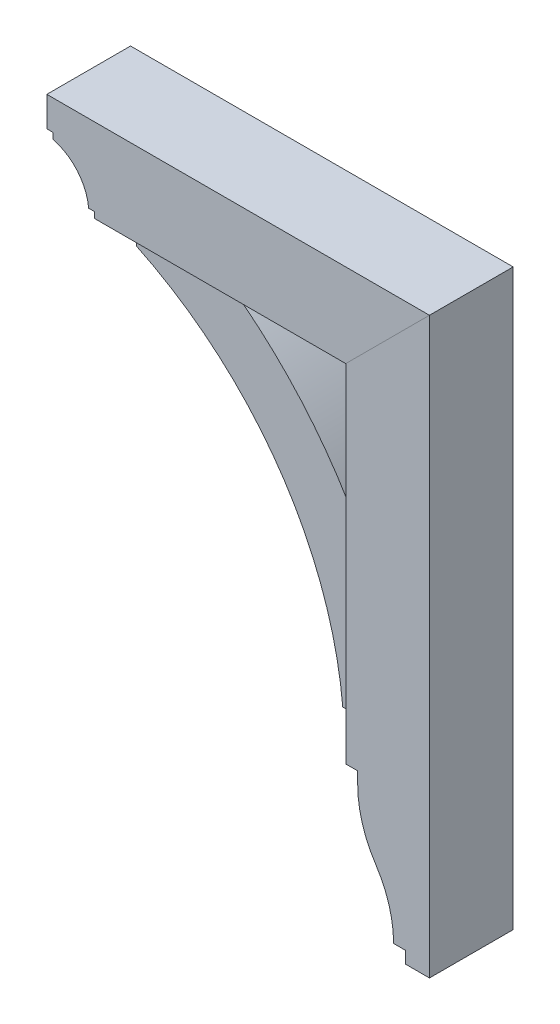
ISO-10303-21;
HEADER;
FILE_DESCRIPTION(('STEP AP214'),'2;1');
FILE_NAME('part.step','',(''),(''),'','','');
FILE_SCHEMA(('AUTOMOTIVE_DESIGN { 1 0 10303 214 1 1 1 1 }'));
ENDSEC;
DATA;
#1=APPLICATION_CONTEXT('core data for automotive mechanical design processes');
#2=APPLICATION_PROTOCOL_DEFINITION('international standard','automotive_design',2000,#1);
#3=PRODUCT_CONTEXT('',#1,'mechanical');
#4=PRODUCT('Part','Part','',(#3));
#5=PRODUCT_RELATED_PRODUCT_CATEGORY('part','',(#4));
#6=PRODUCT_DEFINITION_FORMATION('','',#4);
#7=PRODUCT_DEFINITION_CONTEXT('part definition',#1,'design');
#8=PRODUCT_DEFINITION('design','',#6,#7);
#9=PRODUCT_DEFINITION_SHAPE('','',#8);
#10=(LENGTH_UNIT() NAMED_UNIT(*) SI_UNIT(.MILLI.,.METRE.));
#11=(NAMED_UNIT(*) PLANE_ANGLE_UNIT() SI_UNIT($,.RADIAN.));
#12=(NAMED_UNIT(*) SI_UNIT($,.STERADIAN.) SOLID_ANGLE_UNIT());
#13=UNCERTAINTY_MEASURE_WITH_UNIT(LENGTH_MEASURE(1.E-05),#10,'distance_accuracy_value','');
#14=(GEOMETRIC_REPRESENTATION_CONTEXT(3) GLOBAL_UNCERTAINTY_ASSIGNED_CONTEXT((#13)) GLOBAL_UNIT_ASSIGNED_CONTEXT((#10,
#11,#12)) REPRESENTATION_CONTEXT('',''));
#15=CARTESIAN_POINT('',(0.,0.,0.));
#16=DIRECTION('',(0.,0.,1.));
#17=DIRECTION('',(1.,0.,0.));
#18=AXIS2_PLACEMENT_3D('',#15,#16,#17);
#19=CARTESIAN_POINT('',(246.881223015558,-2.15821431605898E-12,44.45));
#20=DIRECTION('',(1.,0.,0.));
#21=DIRECTION('',(0.,1.,0.));
#22=AXIS2_PLACEMENT_3D('',#19,#20,#21);
#23=PLANE('',#22);
#24=DIRECTION('',(0.,-1.,0.));
#25=VECTOR('',#24,1.);
#26=CARTESIAN_POINT('',(246.881223015558,-2.15821431605898E-12,-44.45));
#27=LINE('',#26,#25);
#28=CARTESIAN_POINT('',(246.881223015556,-183.515,-44.45));
#29=VERTEX_POINT('',#28);
#30=CARTESIAN_POINT('',(246.881223015556,-196.215,-44.45));
#31=VERTEX_POINT('',#30);
#32=EDGE_CURVE('E171',#29,#31,#27,.T.);
#33=ORIENTED_EDGE('',*,*,#32,.T.);
#34=DIRECTION('',(0.,0.,-1.));
#35=VECTOR('',#34,1.);
#36=CARTESIAN_POINT('',(246.881223015556,-196.215,44.45));
#37=LINE('',#36,#35);
#38=CARTESIAN_POINT('',(246.881223015556,-196.215,44.45));
#39=VERTEX_POINT('',#38);
#40=EDGE_CURVE('E12',#39,#31,#37,.T.);
#41=ORIENTED_EDGE('',*,*,#40,.F.);
#42=DIRECTION('',(0.,-1.,0.));
#43=VECTOR('',#42,1.);
#44=CARTESIAN_POINT('',(246.881223015558,-2.15821431605898E-12,44.45));
#45=LINE('',#44,#43);
#46=CARTESIAN_POINT('',(246.881223015556,-183.515,44.45));
#47=VERTEX_POINT('',#46);
#48=EDGE_CURVE('E202',#47,#39,#45,.T.);
#49=ORIENTED_EDGE('',*,*,#48,.F.);
#50=DIRECTION('',(0.,0.,-1.));
#51=VECTOR('',#50,1.);
#52=CARTESIAN_POINT('',(246.881223015556,-183.515,44.45));
#53=LINE('',#52,#51);
#54=EDGE_CURVE('E167',#47,#29,#53,.T.);
#55=ORIENTED_EDGE('',*,*,#54,.T.);
#56=EDGE_LOOP('',(#33,#41,#49,#55));
#57=FACE_BOUND('',#56,.T.);
#58=ADVANCED_FACE('F55',(#57),#23,.F.);
#59=CARTESIAN_POINT('',(362.768723015556,-196.215,44.45));
#60=DIRECTION('',(0.,0.,-1.));
#61=DIRECTION('',(-1.,0.,0.));
#62=AXIS2_PLACEMENT_3D('',#59,#60,#61);
#63=CYLINDRICAL_SURFACE('',#62,115.8875);
#64=CARTESIAN_POINT('',(362.768723015556,-196.215,-44.45));
#65=DIRECTION('',(0.,0.,1.));
#66=DIRECTION('',(1.,0.,0.));
#67=AXIS2_PLACEMENT_3D('',#64,#65,#66);
#68=CIRCLE('',#67,115.8875);
#69=CARTESIAN_POINT('',(266.018608336656,-260.006284403668,-44.45));
#70=VERTEX_POINT('',#69);
#71=EDGE_CURVE('E174',#31,#70,#68,.T.);
#72=ORIENTED_EDGE('',*,*,#71,.T.);
#73=DIRECTION('',(0.,0.,-1.));
#74=VECTOR('',#73,1.);
#75=CARTESIAN_POINT('',(266.018608336656,-260.006284403668,44.45));
#76=LINE('',#75,#74);
#77=CARTESIAN_POINT('',(266.018608336656,-260.006284403668,44.45));
#78=VERTEX_POINT('',#77);
#79=EDGE_CURVE('E64',#78,#70,#76,.T.);
#80=ORIENTED_EDGE('',*,*,#79,.F.);
#81=CARTESIAN_POINT('',(362.768723015556,-196.215,44.45));
#82=DIRECTION('',(0.,0.,1.));
#83=DIRECTION('',(1.,0.,0.));
#84=AXIS2_PLACEMENT_3D('',#81,#82,#83);
#85=CIRCLE('',#84,115.8875);
#86=EDGE_CURVE('E121',#39,#78,#85,.T.);
#87=ORIENTED_EDGE('',*,*,#86,.F.);
#88=ORIENTED_EDGE('',*,*,#40,.T.);
#89=EDGE_LOOP('',(#72,#80,#87,#88));
#90=FACE_BOUND('',#89,.T.);
#91=ADVANCED_FACE('F228',(#90),#63,.T.);
#92=CARTESIAN_POINT('',(170.152056348884,-323.215,44.45));
#93=DIRECTION('',(0.,0.,-1.));
#94=DIRECTION('',(-1.,0.,0.));
#95=AXIS2_PLACEMENT_3D('',#92,#93,#94);
#96=CYLINDRICAL_SURFACE('',#95,114.829166666671);
#97=CARTESIAN_POINT('',(170.152056348884,-323.215,-44.45));
#98=DIRECTION('',(0.,0.,1.));
#99=DIRECTION('',(1.,0.,0.));
#100=AXIS2_PLACEMENT_3D('',#97,#98,#99);
#101=CIRCLE('',#100,114.829166666671);
#102=CARTESIAN_POINT('',(284.981223015555,-323.215,-44.45));
#103=VERTEX_POINT('',#102);
#104=EDGE_CURVE('E178',#103,#70,#101,.T.);
#105=ORIENTED_EDGE('',*,*,#104,.F.);
#106=DIRECTION('',(0.,0.,-1.));
#107=VECTOR('',#106,1.);
#108=CARTESIAN_POINT('',(284.981223015555,-323.215,44.45));
#109=LINE('',#108,#107);
#110=CARTESIAN_POINT('',(284.981223015555,-323.215,44.45));
#111=VERTEX_POINT('',#110);
#112=EDGE_CURVE('E218',#111,#103,#109,.T.);
#113=ORIENTED_EDGE('',*,*,#112,.F.);
#114=CARTESIAN_POINT('',(170.152056348884,-323.215,44.45));
#115=DIRECTION('',(0.,0.,1.));
#116=DIRECTION('',(1.,0.,0.));
#117=AXIS2_PLACEMENT_3D('',#114,#115,#116);
#118=CIRCLE('',#117,114.829166666671);
#119=EDGE_CURVE('E227',#111,#78,#118,.T.);
#120=ORIENTED_EDGE('',*,*,#119,.T.);
#121=ORIENTED_EDGE('',*,*,#79,.T.);
#122=EDGE_LOOP('',(#105,#113,#120,#121));
#123=FACE_BOUND('',#122,.T.);
#124=ADVANCED_FACE('F225',(#123),#96,.F.);
#125=CARTESIAN_POINT('',(0.,-323.215,44.45));
#126=DIRECTION('',(0.,-1.,0.));
#127=DIRECTION('',(0.,0.,-1.));
#128=AXIS2_PLACEMENT_3D('',#125,#126,#127);
#129=PLANE('',#128);
#130=DIRECTION('',(-1.,0.,0.));
#131=VECTOR('',#130,1.);
#132=CARTESIAN_POINT('',(0.,-323.215,-44.45));
#133=LINE('',#132,#131);
#134=CARTESIAN_POINT('',(297.681223015555,-323.215,-44.45));
#135=VERTEX_POINT('',#134);
#136=EDGE_CURVE('E182',#135,#103,#133,.T.);
#137=ORIENTED_EDGE('',*,*,#136,.F.);
#138=DIRECTION('',(0.,0.,-1.));
#139=VECTOR('',#138,1.);
#140=CARTESIAN_POINT('',(297.681223015555,-323.215,44.45));
#141=LINE('',#140,#139);
#142=CARTESIAN_POINT('',(297.681223015555,-323.215,44.45));
#143=VERTEX_POINT('',#142);
#144=EDGE_CURVE('E215',#143,#135,#141,.T.);
#145=ORIENTED_EDGE('',*,*,#144,.F.);
#146=DIRECTION('',(-1.,0.,0.));
#147=VECTOR('',#146,1.);
#148=CARTESIAN_POINT('',(0.,-323.215,44.45));
#149=LINE('',#148,#147);
#150=EDGE_CURVE('E239',#143,#111,#149,.T.);
#151=ORIENTED_EDGE('',*,*,#150,.T.);
#152=ORIENTED_EDGE('',*,*,#112,.T.);
#153=EDGE_LOOP('',(#137,#145,#151,#152));
#154=FACE_BOUND('',#153,.T.);
#155=ADVANCED_FACE('F236',(#154),#129,.T.);
#156=CARTESIAN_POINT('',(297.681223015555,0.,44.45));
#157=DIRECTION('',(-1.,0.,0.));
#158=DIRECTION('',(0.,0.,1.));
#159=AXIS2_PLACEMENT_3D('',#156,#157,#158);
#160=PLANE('',#159);
#161=DIRECTION('',(0.,1.,0.));
#162=VECTOR('',#161,1.);
#163=CARTESIAN_POINT('',(297.681223015555,0.,-44.45));
#164=LINE('',#163,#162);
#165=CARTESIAN_POINT('',(297.681223015555,-335.915,-44.45));
#166=VERTEX_POINT('',#165);
#167=EDGE_CURVE('E185',#166,#135,#164,.T.);
#168=ORIENTED_EDGE('',*,*,#167,.F.);
#169=DIRECTION('',(0.,0.,-1.));
#170=VECTOR('',#169,1.);
#171=CARTESIAN_POINT('',(297.681223015555,-335.915,44.45));
#172=LINE('',#171,#170);
#173=CARTESIAN_POINT('',(297.681223015555,-335.915,44.45));
#174=VERTEX_POINT('',#173);
#175=EDGE_CURVE('E212',#174,#166,#172,.T.);
#176=ORIENTED_EDGE('',*,*,#175,.F.);
#177=DIRECTION('',(0.,1.,0.));
#178=VECTOR('',#177,1.);
#179=CARTESIAN_POINT('',(297.681223015555,0.,44.45));
#180=LINE('',#179,#178);
#181=EDGE_CURVE('E245',#174,#143,#180,.T.);
#182=ORIENTED_EDGE('',*,*,#181,.T.);
#183=ORIENTED_EDGE('',*,*,#144,.T.);
#184=EDGE_LOOP('',(#168,#176,#182,#183));
#185=FACE_BOUND('',#184,.T.);
#186=ADVANCED_FACE('F260',(#185),#160,.T.);
#187=CARTESIAN_POINT('',(7.34134975033387E-13,-335.915000000001,44.45));
#188=DIRECTION('',(0.,-1.,0.));
#189=DIRECTION('',(1.,0.,0.));
#190=AXIS2_PLACEMENT_3D('',#187,#188,#189);
#191=PLANE('',#190);
#192=DIRECTION('',(-1.,0.,0.));
#193=VECTOR('',#192,1.);
#194=CARTESIAN_POINT('',(7.34134975033387E-13,-335.915000000001,-44.45));
#195=LINE('',#194,#193);
#196=CARTESIAN_POINT('',(323.081223015555,-335.915,-44.45));
#197=VERTEX_POINT('',#196);
#198=EDGE_CURVE('E189',#197,#166,#195,.T.);
#199=ORIENTED_EDGE('',*,*,#198,.F.);
#200=DIRECTION('',(0.,0.,-1.));
#201=VECTOR('',#200,1.);
#202=CARTESIAN_POINT('',(323.081223015555,-335.915,44.45));
#203=LINE('',#202,#201);
#204=CARTESIAN_POINT('',(323.081223015555,-335.915,44.45));
#205=VERTEX_POINT('',#204);
#206=EDGE_CURVE('E209',#205,#197,#203,.T.);
#207=ORIENTED_EDGE('',*,*,#206,.F.);
#208=DIRECTION('',(-1.,0.,0.));
#209=VECTOR('',#208,1.);
#210=CARTESIAN_POINT('',(7.34134975033387E-13,-335.915000000001,44.45));
#211=LINE('',#210,#209);
#212=EDGE_CURVE('E253',#205,#174,#211,.T.);
#213=ORIENTED_EDGE('',*,*,#212,.T.);
#214=ORIENTED_EDGE('',*,*,#175,.T.);
#215=EDGE_LOOP('',(#199,#207,#213,#214));
#216=FACE_BOUND('',#215,.T.);
#217=ADVANCED_FACE('F258',(#216),#191,.T.);
#218=CARTESIAN_POINT('',(323.081223015555,0.,44.45));
#219=DIRECTION('',(-1.,0.,0.));
#220=DIRECTION('',(0.,0.,1.));
#221=AXIS2_PLACEMENT_3D('',#218,#219,#220);
#222=PLANE('',#221);
#223=DIRECTION('',(0.,1.,0.));
#224=VECTOR('',#223,1.);
#225=CARTESIAN_POINT('',(323.081223015555,0.,-44.45));
#226=LINE('',#225,#224);
#227=CARTESIAN_POINT('',(323.081223015555,273.685,-44.45));
#228=VERTEX_POINT('',#227);
#229=EDGE_CURVE('E193',#197,#228,#226,.T.);
#230=ORIENTED_EDGE('',*,*,#229,.T.);
#231=DIRECTION('',(0.,0.,-1.));
#232=VECTOR('',#231,1.);
#233=CARTESIAN_POINT('',(323.081223015555,273.685,44.45));
#234=LINE('',#233,#232);
#235=CARTESIAN_POINT('',(323.081223015555,273.685,44.45));
#236=VERTEX_POINT('',#235);
#237=EDGE_CURVE('E158',#236,#228,#234,.T.);
#238=ORIENTED_EDGE('',*,*,#237,.F.);
#239=DIRECTION('',(0.,1.,0.));
#240=VECTOR('',#239,1.);
#241=CARTESIAN_POINT('',(323.081223015555,0.,44.45));
#242=LINE('',#241,#240);
#243=EDGE_CURVE('E147',#205,#236,#242,.T.);
#244=ORIENTED_EDGE('',*,*,#243,.F.);
#245=ORIENTED_EDGE('',*,*,#206,.T.);
#246=EDGE_LOOP('',(#230,#238,#244,#245));
#247=FACE_BOUND('',#246,.T.);
#248=ADVANCED_FACE('F263',(#247),#222,.F.);
#249=CARTESIAN_POINT('',(24.6981115077795,-24.6981115077792,44.45));
#250=DIRECTION('',(0.707106781186552,-0.707106781186543,0.));
#251=DIRECTION('',(0.707106781186543,0.707106781186552,0.));
#252=AXIS2_PLACEMENT_3D('',#249,#250,#251);
#253=PLANE('',#252);
#254=DIRECTION('',(-0.707106781186543,-0.707106781186552,0.));
#255=VECTOR('',#254,1.);
#256=CARTESIAN_POINT('',(24.6981115077795,-24.6981115077792,-44.45));
#257=LINE('',#256,#255);
#258=CARTESIAN_POINT('',(234.181223015556,184.785,-44.45));
#259=VERTEX_POINT('',#258);
#260=EDGE_CURVE('E156',#228,#259,#257,.T.);
#261=ORIENTED_EDGE('',*,*,#260,.T.);
#262=DIRECTION('',(0.,0.,-1.));
#263=VECTOR('',#262,1.);
#264=CARTESIAN_POINT('',(234.181223015556,184.785,44.45));
#265=LINE('',#264,#263);
#266=CARTESIAN_POINT('',(234.181223015556,184.785,44.45));
#267=VERTEX_POINT('',#266);
#268=EDGE_CURVE('E153',#267,#259,#265,.T.);
#269=ORIENTED_EDGE('',*,*,#268,.F.);
#270=DIRECTION('',(-0.707106781186543,-0.707106781186552,0.));
#271=VECTOR('',#270,1.);
#272=CARTESIAN_POINT('',(24.6981115077795,-24.6981115077792,44.45));
#273=LINE('',#272,#271);
#274=EDGE_CURVE('E140',#236,#267,#273,.T.);
#275=ORIENTED_EDGE('',*,*,#274,.F.);
#276=ORIENTED_EDGE('',*,*,#237,.T.);
#277=EDGE_LOOP('',(#261,#269,#275,#276));
#278=FACE_BOUND('',#277,.T.);
#279=ADVANCED_FACE('F154',(#278),#253,.F.);
#280=CARTESIAN_POINT('',(234.181223015556,0.,44.45));
#281=DIRECTION('',(1.,0.,0.));
#282=DIRECTION('',(0.,1.,0.));
#283=AXIS2_PLACEMENT_3D('',#280,#281,#282);
#284=PLANE('',#283);
#285=DIRECTION('',(0.,-1.,0.));
#286=VECTOR('',#285,1.);
#287=CARTESIAN_POINT('',(234.181223015556,0.,-44.45));
#288=LINE('',#287,#286);
#289=CARTESIAN_POINT('',(234.181223015556,-183.515,-44.45));
#290=VERTEX_POINT('',#289);
#291=EDGE_CURVE('E107',#259,#290,#288,.T.);
#292=ORIENTED_EDGE('',*,*,#291,.T.);
#293=DIRECTION('',(0.,0.,-1.));
#294=VECTOR('',#293,1.);
#295=CARTESIAN_POINT('',(234.181223015556,-183.515,44.45));
#296=LINE('',#295,#294);
#297=CARTESIAN_POINT('',(234.181223015556,-183.515,44.45));
#298=VERTEX_POINT('',#297);
#299=EDGE_CURVE('E159',#298,#290,#296,.T.);
#300=ORIENTED_EDGE('',*,*,#299,.F.);
#301=DIRECTION('',(0.,-1.,0.));
#302=VECTOR('',#301,1.);
#303=CARTESIAN_POINT('',(234.181223015556,0.,44.45));
#304=LINE('',#303,#302);
#305=EDGE_CURVE('E144',#267,#298,#304,.T.);
#306=ORIENTED_EDGE('',*,*,#305,.F.);
#307=ORIENTED_EDGE('',*,*,#268,.T.);
#308=EDGE_LOOP('',(#292,#300,#306,#307));
#309=FACE_BOUND('',#308,.T.);
#310=ADVANCED_FACE('F161',(#309),#284,.F.);
#311=CARTESIAN_POINT('',(0.,-183.515,44.45));
#312=DIRECTION('',(0.,1.,0.));
#313=DIRECTION('',(0.,0.,1.));
#314=AXIS2_PLACEMENT_3D('',#311,#312,#313);
#315=PLANE('',#314);
#316=DIRECTION('',(1.,0.,0.));
#317=VECTOR('',#316,1.);
#318=CARTESIAN_POINT('',(0.,-183.515,-44.45));
#319=LINE('',#318,#317);
#320=EDGE_CURVE('E113',#290,#29,#319,.T.);
#321=ORIENTED_EDGE('',*,*,#320,.T.);
#322=ORIENTED_EDGE('',*,*,#54,.F.);
#323=DIRECTION('',(1.,0.,0.));
#324=VECTOR('',#323,1.);
#325=CARTESIAN_POINT('',(0.,-183.515,44.45));
#326=LINE('',#325,#324);
#327=EDGE_CURVE('E72',#298,#47,#326,.T.);
#328=ORIENTED_EDGE('',*,*,#327,.F.);
#329=ORIENTED_EDGE('',*,*,#299,.T.);
#330=EDGE_LOOP('',(#321,#322,#328,#329));
#331=FACE_BOUND('',#330,.T.);
#332=ADVANCED_FACE('F278',(#331),#315,.F.);
#333=CARTESIAN_POINT('',(0.,0.,44.45));
#334=DIRECTION('',(0.,0.,1.));
#335=DIRECTION('',(1.,0.,0.));
#336=AXIS2_PLACEMENT_3D('',#333,#334,#335);
#337=PLANE('',#336);
#338=ORIENTED_EDGE('',*,*,#48,.T.);
#339=ORIENTED_EDGE('',*,*,#86,.T.);
#340=ORIENTED_EDGE('',*,*,#119,.F.);
#341=ORIENTED_EDGE('',*,*,#150,.F.);
#342=ORIENTED_EDGE('',*,*,#181,.F.);
#343=ORIENTED_EDGE('',*,*,#212,.F.);
#344=ORIENTED_EDGE('',*,*,#243,.T.);
#345=ORIENTED_EDGE('',*,*,#274,.T.);
#346=ORIENTED_EDGE('',*,*,#305,.T.);
#347=ORIENTED_EDGE('',*,*,#327,.T.);
#348=EDGE_LOOP('',(#338,#339,#340,#341,#342,#343,#344,#345,#346,#347));
#349=FACE_BOUND('',#348,.T.);
#350=ADVANCED_FACE('F142',(#349),#337,.T.);
#351=CARTESIAN_POINT('',(0.,0.,-44.45));
#352=DIRECTION('',(0.,0.,1.));
#353=DIRECTION('',(1.,0.,0.));
#354=AXIS2_PLACEMENT_3D('',#351,#352,#353);
#355=PLANE('',#354);
#356=ORIENTED_EDGE('',*,*,#32,.F.);
#357=ORIENTED_EDGE('',*,*,#320,.F.);
#358=ORIENTED_EDGE('',*,*,#291,.F.);
#359=ORIENTED_EDGE('',*,*,#260,.F.);
#360=ORIENTED_EDGE('',*,*,#229,.F.);
#361=ORIENTED_EDGE('',*,*,#198,.T.);
#362=ORIENTED_EDGE('',*,*,#167,.T.);
#363=ORIENTED_EDGE('',*,*,#136,.T.);
#364=ORIENTED_EDGE('',*,*,#104,.T.);
#365=ORIENTED_EDGE('',*,*,#71,.F.);
#366=EDGE_LOOP('',(#356,#357,#358,#359,#360,#361,#362,#363,#364,#365));
#367=FACE_BOUND('',#366,.T.);
#368=ADVANCED_FACE('F232',(#367),#355,.F.);
#369=CLOSED_SHELL('',(#58,#91,#124,#155,#186,#217,#248,#279,#310,#332,#350,#368));
#370=MANIFOLD_SOLID_BREP('B2',#369);
#371=CARTESIAN_POINT('',(-169.196626797865,-187.594019533007,31.75));
#372=DIRECTION('',(0.,0.,-1.));
#373=DIRECTION('',(-1.,0.,0.));
#374=AXIS2_PLACEMENT_3D('',#371,#372,#373);
#375=CYLINDRICAL_SURFACE('',#374,457.2);
#376=CARTESIAN_POINT('',(-169.196626797865,-187.594019533007,-31.75));
#377=DIRECTION('',(0.,0.,1.));
#378=DIRECTION('',(1.,0.,0.));
#379=AXIS2_PLACEMENT_3D('',#376,#377,#378);
#380=CIRCLE('',#379,457.2);
#381=CARTESIAN_POINT('',(96.0687230155559,184.785,-31.75));
#382=VERTEX_POINT('',#381);
#383=CARTESIAN_POINT('',(234.181223015556,27.6224999999997,-31.75));
#384=VERTEX_POINT('',#383);
#385=EDGE_CURVE('E473',#382,#384,#380,.F.);
#386=ORIENTED_EDGE('',*,*,#385,.F.);
#387=DIRECTION('',(0.,0.,-1.));
#388=VECTOR('',#387,1.);
#389=CARTESIAN_POINT('',(96.0687230155559,184.785,31.75));
#390=LINE('',#389,#388);
#391=CARTESIAN_POINT('',(96.0687230155559,184.785,31.75));
#392=VERTEX_POINT('',#391);
#393=EDGE_CURVE('E53',#392,#382,#390,.T.);
#394=ORIENTED_EDGE('',*,*,#393,.F.);
#395=CARTESIAN_POINT('',(-169.196626797865,-187.594019533007,31.75));
#396=DIRECTION('',(0.,0.,1.));
#397=DIRECTION('',(1.,0.,0.));
#398=AXIS2_PLACEMENT_3D('',#395,#396,#397);
#399=CIRCLE('',#398,457.2);
#400=CARTESIAN_POINT('',(234.181223015556,27.6224999999997,31.75));
#401=VERTEX_POINT('',#400);
#402=EDGE_CURVE('E491',#392,#401,#399,.F.);
#403=ORIENTED_EDGE('',*,*,#402,.T.);
#404=DIRECTION('',(0.,0.,-1.));
#405=VECTOR('',#404,1.);
#406=CARTESIAN_POINT('',(234.181223015556,27.6224999999997,31.75));
#407=LINE('',#406,#405);
#408=EDGE_CURVE('E402',#401,#384,#407,.T.);
#409=ORIENTED_EDGE('',*,*,#408,.T.);
#410=EDGE_LOOP('',(#386,#394,#403,#409));
#411=FACE_BOUND('',#410,.T.);
#412=ADVANCED_FACE('F385',(#411),#375,.T.);
#413=CARTESIAN_POINT('',(0.,184.785,31.75));
#414=DIRECTION('',(0.,1.,0.));
#415=DIRECTION('',(0.,0.,1.));
#416=AXIS2_PLACEMENT_3D('',#413,#414,#415);
#417=PLANE('',#416);
#418=DIRECTION('',(1.,0.,0.));
#419=VECTOR('',#418,1.);
#420=CARTESIAN_POINT('',(0.,184.785,-31.75));
#421=LINE('',#420,#419);
#422=CARTESIAN_POINT('',(-0.768776984445107,184.785,-31.75));
#423=VERTEX_POINT('',#422);
#424=EDGE_CURVE('E476',#423,#382,#421,.T.);
#425=ORIENTED_EDGE('',*,*,#424,.F.);
#426=DIRECTION('',(0.,0.,-1.));
#427=VECTOR('',#426,1.);
#428=CARTESIAN_POINT('',(-0.768776984445107,184.785,31.75));
#429=LINE('',#428,#427);
#430=CARTESIAN_POINT('',(-0.768776984445107,184.785,31.75));
#431=VERTEX_POINT('',#430);
#432=EDGE_CURVE('E394',#431,#423,#429,.T.);
#433=ORIENTED_EDGE('',*,*,#432,.F.);
#434=DIRECTION('',(1.,0.,0.));
#435=VECTOR('',#434,1.);
#436=CARTESIAN_POINT('',(0.,184.785,31.75));
#437=LINE('',#436,#435);
#438=EDGE_CURVE('E507',#431,#392,#437,.T.);
#439=ORIENTED_EDGE('',*,*,#438,.T.);
#440=ORIENTED_EDGE('',*,*,#393,.T.);
#441=EDGE_LOOP('',(#425,#433,#439,#440));
#442=FACE_BOUND('',#441,.T.);
#443=ADVANCED_FACE('F506',(#442),#417,.T.);
#444=CARTESIAN_POINT('',(-0.76877698444509,0.,31.75));
#445=DIRECTION('',(1.,0.,0.));
#446=DIRECTION('',(0.,1.,0.));
#447=AXIS2_PLACEMENT_3D('',#444,#445,#446);
#448=PLANE('',#447);
#449=DIRECTION('',(0.,-1.,0.));
#450=VECTOR('',#449,1.);
#451=CARTESIAN_POINT('',(-0.76877698444509,0.,-31.75));
#452=LINE('',#451,#450);
#453=CARTESIAN_POINT('',(-0.768776984445106,168.91,-31.75));
#454=VERTEX_POINT('',#453);
#455=EDGE_CURVE('E480',#423,#454,#452,.T.);
#456=ORIENTED_EDGE('',*,*,#455,.T.);
#457=DIRECTION('',(0.,0.,-1.));
#458=VECTOR('',#457,1.);
#459=CARTESIAN_POINT('',(-0.768776984445106,168.91,31.75));
#460=LINE('',#459,#458);
#461=CARTESIAN_POINT('',(-0.768776984445106,168.91,31.75));
#462=VERTEX_POINT('',#461);
#463=EDGE_CURVE('E462',#462,#454,#460,.T.);
#464=ORIENTED_EDGE('',*,*,#463,.F.);
#465=DIRECTION('',(0.,-1.,0.));
#466=VECTOR('',#465,1.);
#467=CARTESIAN_POINT('',(-0.76877698444509,0.,31.75));
#468=LINE('',#467,#466);
#469=EDGE_CURVE('E448',#431,#462,#468,.T.);
#470=ORIENTED_EDGE('',*,*,#469,.F.);
#471=ORIENTED_EDGE('',*,*,#432,.T.);
#472=EDGE_LOOP('',(#456,#464,#470,#471));
#473=FACE_BOUND('',#472,.T.);
#474=ADVANCED_FACE('F500',(#473),#448,.F.);
#475=CARTESIAN_POINT('',(-167.428414314759,-180.753535109008,31.75));
#476=DIRECTION('',(0.,0.,-1.));
#477=DIRECTION('',(-1.,0.,0.));
#478=AXIS2_PLACEMENT_3D('',#475,#476,#477);
#479=CYLINDRICAL_SURFACE('',#478,387.35);
#480=CARTESIAN_POINT('',(-167.428414314759,-180.753535109008,-31.75));
#481=DIRECTION('',(0.,0.,1.));
#482=DIRECTION('',(1.,0.,0.));
#483=AXIS2_PLACEMENT_3D('',#480,#481,#482);
#484=CIRCLE('',#483,387.35);
#485=CARTESIAN_POINT('',(218.306223015556,-145.415,-31.75));
#486=VERTEX_POINT('',#485);
#487=EDGE_CURVE('E458',#454,#486,#484,.F.);
#488=ORIENTED_EDGE('',*,*,#487,.T.);
#489=DIRECTION('',(0.,0.,-1.));
#490=VECTOR('',#489,1.);
#491=CARTESIAN_POINT('',(218.306223015556,-145.415,31.75));
#492=LINE('',#491,#490);
#493=CARTESIAN_POINT('',(218.306223015556,-145.415,31.75));
#494=VERTEX_POINT('',#493);
#495=EDGE_CURVE('E455',#494,#486,#492,.T.);
#496=ORIENTED_EDGE('',*,*,#495,.F.);
#497=CARTESIAN_POINT('',(-167.428414314759,-180.753535109008,31.75));
#498=DIRECTION('',(0.,0.,1.));
#499=DIRECTION('',(1.,0.,0.));
#500=AXIS2_PLACEMENT_3D('',#497,#498,#499);
#501=CIRCLE('',#500,387.35);
#502=EDGE_CURVE('E440',#462,#494,#501,.F.);
#503=ORIENTED_EDGE('',*,*,#502,.F.);
#504=ORIENTED_EDGE('',*,*,#463,.T.);
#505=EDGE_LOOP('',(#488,#496,#503,#504));
#506=FACE_BOUND('',#505,.T.);
#507=ADVANCED_FACE('F456',(#506),#479,.F.);
#508=CARTESIAN_POINT('',(2.54241072639162E-13,-145.415,31.75));
#509=DIRECTION('',(0.,-1.,0.));
#510=DIRECTION('',(1.,0.,0.));
#511=AXIS2_PLACEMENT_3D('',#508,#509,#510);
#512=PLANE('',#511);
#513=DIRECTION('',(-1.,0.,0.));
#514=VECTOR('',#513,1.);
#515=CARTESIAN_POINT('',(2.54241072639162E-13,-145.415,-31.75));
#516=LINE('',#515,#514);
#517=CARTESIAN_POINT('',(234.181223015556,-145.415,-31.75));
#518=VERTEX_POINT('',#517);
#519=EDGE_CURVE('E485',#518,#486,#516,.T.);
#520=ORIENTED_EDGE('',*,*,#519,.F.);
#521=DIRECTION('',(0.,0.,-1.));
#522=VECTOR('',#521,1.);
#523=CARTESIAN_POINT('',(234.181223015556,-145.415,31.75));
#524=LINE('',#523,#522);
#525=CARTESIAN_POINT('',(234.181223015556,-145.415,31.75));
#526=VERTEX_POINT('',#525);
#527=EDGE_CURVE('E421',#526,#518,#524,.T.);
#528=ORIENTED_EDGE('',*,*,#527,.F.);
#529=DIRECTION('',(-1.,0.,0.));
#530=VECTOR('',#529,1.);
#531=CARTESIAN_POINT('',(2.54241072639162E-13,-145.415,31.75));
#532=LINE('',#531,#530);
#533=EDGE_CURVE('E445',#526,#494,#532,.T.);
#534=ORIENTED_EDGE('',*,*,#533,.T.);
#535=ORIENTED_EDGE('',*,*,#495,.T.);
#536=EDGE_LOOP('',(#520,#528,#534,#535));
#537=FACE_BOUND('',#536,.T.);
#538=ADVANCED_FACE('F464',(#537),#512,.T.);
#539=CARTESIAN_POINT('',(234.181223015556,0.,31.75));
#540=DIRECTION('',(1.,0.,0.));
#541=DIRECTION('',(0.,1.,0.));
#542=AXIS2_PLACEMENT_3D('',#539,#540,#541);
#543=PLANE('',#542);
#544=DIRECTION('',(0.,-1.,0.));
#545=VECTOR('',#544,1.);
#546=CARTESIAN_POINT('',(234.181223015556,0.,-31.75));
#547=LINE('',#546,#545);
#548=EDGE_CURVE('E487',#384,#518,#547,.T.);
#549=ORIENTED_EDGE('',*,*,#548,.F.);
#550=ORIENTED_EDGE('',*,*,#408,.F.);
#551=DIRECTION('',(0.,-1.,0.));
#552=VECTOR('',#551,1.);
#553=CARTESIAN_POINT('',(234.181223015556,0.,31.75));
#554=LINE('',#553,#552);
#555=EDGE_CURVE('E466',#401,#526,#554,.T.);
#556=ORIENTED_EDGE('',*,*,#555,.T.);
#557=ORIENTED_EDGE('',*,*,#527,.T.);
#558=EDGE_LOOP('',(#549,#550,#556,#557));
#559=FACE_BOUND('',#558,.T.);
#560=ADVANCED_FACE('F508',(#559),#543,.T.);
#561=CARTESIAN_POINT('',(0.,0.,31.75));
#562=DIRECTION('',(0.,0.,1.));
#563=DIRECTION('',(1.,0.,0.));
#564=AXIS2_PLACEMENT_3D('',#561,#562,#563);
#565=PLANE('',#564);
#566=ORIENTED_EDGE('',*,*,#402,.F.);
#567=ORIENTED_EDGE('',*,*,#438,.F.);
#568=ORIENTED_EDGE('',*,*,#469,.T.);
#569=ORIENTED_EDGE('',*,*,#502,.T.);
#570=ORIENTED_EDGE('',*,*,#533,.F.);
#571=ORIENTED_EDGE('',*,*,#555,.F.);
#572=EDGE_LOOP('',(#566,#567,#568,#569,#570,#571));
#573=FACE_BOUND('',#572,.T.);
#574=ADVANCED_FACE('F442',(#573),#565,.T.);
#575=CARTESIAN_POINT('',(0.,0.,-31.75));
#576=DIRECTION('',(0.,0.,1.));
#577=DIRECTION('',(1.,0.,0.));
#578=AXIS2_PLACEMENT_3D('',#575,#576,#577);
#579=PLANE('',#578);
#580=ORIENTED_EDGE('',*,*,#385,.T.);
#581=ORIENTED_EDGE('',*,*,#548,.T.);
#582=ORIENTED_EDGE('',*,*,#519,.T.);
#583=ORIENTED_EDGE('',*,*,#487,.F.);
#584=ORIENTED_EDGE('',*,*,#455,.F.);
#585=ORIENTED_EDGE('',*,*,#424,.T.);
#586=EDGE_LOOP('',(#580,#581,#582,#583,#584,#585));
#587=FACE_BOUND('',#586,.T.);
#588=ADVANCED_FACE('F505',(#587),#579,.F.);
#589=CLOSED_SHELL('',(#412,#443,#474,#507,#538,#560,#574,#588));
#590=MANIFOLD_SOLID_BREP('B6',#589);
#591=CARTESIAN_POINT('',(-76.9687769844452,0.,44.45));
#592=DIRECTION('',(-1.,0.,0.));
#593=DIRECTION('',(0.,0.,1.));
#594=AXIS2_PLACEMENT_3D('',#591,#592,#593);
#595=PLANE('',#594);
#596=DIRECTION('',(0.,1.,0.));
#597=VECTOR('',#596,1.);
#598=CARTESIAN_POINT('',(-76.9687769844452,0.,-44.45));
#599=LINE('',#598,#597);
#600=CARTESIAN_POINT('',(-76.9687769844452,235.585,-44.45));
#601=VERTEX_POINT('',#600);
#602=CARTESIAN_POINT('',(-76.9687769844452,241.935,-44.45));
#603=VERTEX_POINT('',#602);
#604=EDGE_CURVE('E691',#601,#603,#599,.T.);
#605=ORIENTED_EDGE('',*,*,#604,.F.);
#606=DIRECTION('',(0.,0.,-1.));
#607=VECTOR('',#606,1.);
#608=CARTESIAN_POINT('',(-76.9687769844452,235.585,44.45));
#609=LINE('',#608,#607);
#610=CARTESIAN_POINT('',(-76.9687769844452,235.585,44.45));
#611=VERTEX_POINT('',#610);
#612=EDGE_CURVE('E383',#611,#601,#609,.T.);
#613=ORIENTED_EDGE('',*,*,#612,.F.);
#614=DIRECTION('',(0.,1.,0.));
#615=VECTOR('',#614,1.);
#616=CARTESIAN_POINT('',(-76.9687769844452,0.,44.45));
#617=LINE('',#616,#615);
#618=CARTESIAN_POINT('',(-76.9687769844452,241.935,44.45));
#619=VERTEX_POINT('',#618);
#620=EDGE_CURVE('E723',#611,#619,#617,.T.);
#621=ORIENTED_EDGE('',*,*,#620,.T.);
#622=DIRECTION('',(0.,0.,-1.));
#623=VECTOR('',#622,1.);
#624=CARTESIAN_POINT('',(-76.9687769844452,241.935,44.45));
#625=LINE('',#624,#623);
#626=EDGE_CURVE('E603',#619,#603,#625,.T.);
#627=ORIENTED_EDGE('',*,*,#626,.T.);
#628=EDGE_LOOP('',(#605,#613,#621,#627));
#629=FACE_BOUND('',#628,.T.);
#630=ADVANCED_FACE('F586',(#629),#595,.T.);
#631=CARTESIAN_POINT('',(-89.3801017368838,186.393150212195,44.45));
#632=DIRECTION('',(0.,0.,-1.));
#633=DIRECTION('',(-1.,0.,0.));
#634=AXIS2_PLACEMENT_3D('',#631,#632,#633);
#635=CYLINDRICAL_SURFACE('',#634,50.7334117486339);
#636=CARTESIAN_POINT('',(-89.3801017368838,186.393150212195,-44.45));
#637=DIRECTION('',(0.,0.,1.));
#638=DIRECTION('',(1.,0.,0.));
#639=AXIS2_PLACEMENT_3D('',#636,#637,#638);
#640=CIRCLE('',#639,50.7334117486339);
#641=CARTESIAN_POINT('',(-38.8687769844451,191.135,-44.45));
#642=VERTEX_POINT('',#641);
#643=EDGE_CURVE('E694',#601,#642,#640,.F.);
#644=ORIENTED_EDGE('',*,*,#643,.T.);
#645=DIRECTION('',(0.,0.,-1.));
#646=VECTOR('',#645,1.);
#647=CARTESIAN_POINT('',(-38.8687769844451,191.135,44.45));
#648=LINE('',#647,#646);
#649=CARTESIAN_POINT('',(-38.8687769844451,191.135,44.45));
#650=VERTEX_POINT('',#649);
#651=EDGE_CURVE('E595',#650,#642,#648,.T.);
#652=ORIENTED_EDGE('',*,*,#651,.F.);
#653=CARTESIAN_POINT('',(-89.3801017368838,186.393150212195,44.45));
#654=DIRECTION('',(0.,0.,1.));
#655=DIRECTION('',(1.,0.,0.));
#656=AXIS2_PLACEMENT_3D('',#653,#654,#655);
#657=CIRCLE('',#656,50.7334117486339);
#658=EDGE_CURVE('E758',#611,#650,#657,.F.);
#659=ORIENTED_EDGE('',*,*,#658,.F.);
#660=ORIENTED_EDGE('',*,*,#612,.T.);
#661=EDGE_LOOP('',(#644,#652,#659,#660));
#662=FACE_BOUND('',#661,.T.);
#663=ADVANCED_FACE('F747',(#662),#635,.F.);
#664=CARTESIAN_POINT('',(-8.35442826030431E-13,191.135,44.45));
#665=DIRECTION('',(0.,-1.,0.));
#666=DIRECTION('',(1.,0.,0.));
#667=AXIS2_PLACEMENT_3D('',#664,#665,#666);
#668=PLANE('',#667);
#669=DIRECTION('',(-1.,0.,0.));
#670=VECTOR('',#669,1.);
#671=CARTESIAN_POINT('',(-8.35442826030431E-13,191.135,-44.45));
#672=LINE('',#671,#670);
#673=CARTESIAN_POINT('',(-32.5187769844451,191.135,-44.45));
#674=VERTEX_POINT('',#673);
#675=EDGE_CURVE('E698',#674,#642,#672,.T.);
#676=ORIENTED_EDGE('',*,*,#675,.F.);
#677=DIRECTION('',(0.,0.,-1.));
#678=VECTOR('',#677,1.);
#679=CARTESIAN_POINT('',(-32.5187769844451,191.135,44.45));
#680=LINE('',#679,#678);
#681=CARTESIAN_POINT('',(-32.5187769844451,191.135,44.45));
#682=VERTEX_POINT('',#681);
#683=EDGE_CURVE('E735',#682,#674,#680,.T.);
#684=ORIENTED_EDGE('',*,*,#683,.F.);
#685=DIRECTION('',(-1.,0.,0.));
#686=VECTOR('',#685,1.);
#687=CARTESIAN_POINT('',(-8.35442826030431E-13,191.135,44.45));
#688=LINE('',#687,#686);
#689=EDGE_CURVE('E744',#682,#650,#688,.T.);
#690=ORIENTED_EDGE('',*,*,#689,.T.);
#691=ORIENTED_EDGE('',*,*,#651,.T.);
#692=EDGE_LOOP('',(#676,#684,#690,#691));
#693=FACE_BOUND('',#692,.T.);
#694=ADVANCED_FACE('F742',(#693),#668,.T.);
#695=CARTESIAN_POINT('',(-32.5187769844451,0.,44.45));
#696=DIRECTION('',(-1.,0.,0.));
#697=DIRECTION('',(0.,0.,1.));
#698=AXIS2_PLACEMENT_3D('',#695,#696,#697);
#699=PLANE('',#698);
#700=DIRECTION('',(0.,1.,0.));
#701=VECTOR('',#700,1.);
#702=CARTESIAN_POINT('',(-32.5187769844451,0.,-44.45));
#703=LINE('',#702,#701);
#704=CARTESIAN_POINT('',(-32.5187769844451,184.785,-44.45));
#705=VERTEX_POINT('',#704);
#706=EDGE_CURVE('E702',#705,#674,#703,.T.);
#707=ORIENTED_EDGE('',*,*,#706,.F.);
#708=DIRECTION('',(0.,0.,-1.));
#709=VECTOR('',#708,1.);
#710=CARTESIAN_POINT('',(-32.5187769844451,184.785,44.45));
#711=LINE('',#710,#709);
#712=CARTESIAN_POINT('',(-32.5187769844451,184.785,44.45));
#713=VERTEX_POINT('',#712);
#714=EDGE_CURVE('E733',#713,#705,#711,.T.);
#715=ORIENTED_EDGE('',*,*,#714,.F.);
#716=DIRECTION('',(0.,1.,0.));
#717=VECTOR('',#716,1.);
#718=CARTESIAN_POINT('',(-32.5187769844451,0.,44.45));
#719=LINE('',#718,#717);
#720=EDGE_CURVE('E757',#713,#682,#719,.T.);
#721=ORIENTED_EDGE('',*,*,#720,.T.);
#722=ORIENTED_EDGE('',*,*,#683,.T.);
#723=EDGE_LOOP('',(#707,#715,#721,#722));
#724=FACE_BOUND('',#723,.T.);
#725=ADVANCED_FACE('F753',(#724),#699,.T.);
#726=CARTESIAN_POINT('',(0.,184.785,44.45));
#727=DIRECTION('',(0.,1.,0.));
#728=DIRECTION('',(0.,0.,1.));
#729=AXIS2_PLACEMENT_3D('',#726,#727,#728);
#730=PLANE('',#729);
#731=DIRECTION('',(1.,0.,0.));
#732=VECTOR('',#731,1.);
#733=CARTESIAN_POINT('',(0.,184.785,-44.45));
#734=LINE('',#733,#732);
#735=CARTESIAN_POINT('',(234.181223015556,184.785,-44.45));
#736=VERTEX_POINT('',#735);
#737=EDGE_CURVE('E706',#705,#736,#734,.T.);
#738=ORIENTED_EDGE('',*,*,#737,.T.);
#739=DIRECTION('',(0.,0.,-1.));
#740=VECTOR('',#739,1.);
#741=CARTESIAN_POINT('',(234.181223015556,184.785,44.45));
#742=LINE('',#741,#740);
#743=CARTESIAN_POINT('',(234.181223015556,184.785,44.45));
#744=VERTEX_POINT('',#743);
#745=EDGE_CURVE('E730',#744,#736,#742,.T.);
#746=ORIENTED_EDGE('',*,*,#745,.F.);
#747=DIRECTION('',(1.,0.,0.));
#748=VECTOR('',#747,1.);
#749=CARTESIAN_POINT('',(0.,184.785,44.45));
#750=LINE('',#749,#748);
#751=EDGE_CURVE('E762',#713,#744,#750,.T.);
#752=ORIENTED_EDGE('',*,*,#751,.F.);
#753=ORIENTED_EDGE('',*,*,#714,.T.);
#754=EDGE_LOOP('',(#738,#746,#752,#753));
#755=FACE_BOUND('',#754,.T.);
#756=ADVANCED_FACE('F795',(#755),#730,.F.);
#757=CARTESIAN_POINT('',(24.6981115077795,-24.6981115077792,44.45));
#758=DIRECTION('',(0.707106781186552,-0.707106781186543,0.));
#759=DIRECTION('',(0.707106781186543,0.707106781186552,0.));
#760=AXIS2_PLACEMENT_3D('',#757,#758,#759);
#761=PLANE('',#760);
#762=DIRECTION('',(-0.707106781186543,-0.707106781186552,0.));
#763=VECTOR('',#762,1.);
#764=CARTESIAN_POINT('',(24.6981115077795,-24.6981115077792,-44.45));
#765=LINE('',#764,#763);
#766=CARTESIAN_POINT('',(323.081223015555,273.685,-44.45));
#767=VERTEX_POINT('',#766);
#768=EDGE_CURVE('E710',#767,#736,#765,.T.);
#769=ORIENTED_EDGE('',*,*,#768,.F.);
#770=DIRECTION('',(0.,0.,-1.));
#771=VECTOR('',#770,1.);
#772=CARTESIAN_POINT('',(323.081223015555,273.685,44.45));
#773=LINE('',#772,#771);
#774=CARTESIAN_POINT('',(323.081223015555,273.685,44.45));
#775=VERTEX_POINT('',#774);
#776=EDGE_CURVE('E680',#775,#767,#773,.T.);
#777=ORIENTED_EDGE('',*,*,#776,.F.);
#778=DIRECTION('',(-0.707106781186543,-0.707106781186552,0.));
#779=VECTOR('',#778,1.);
#780=CARTESIAN_POINT('',(24.6981115077795,-24.6981115077792,44.45));
#781=LINE('',#780,#779);
#782=EDGE_CURVE('E668',#775,#744,#781,.T.);
#783=ORIENTED_EDGE('',*,*,#782,.T.);
#784=ORIENTED_EDGE('',*,*,#745,.T.);
#785=EDGE_LOOP('',(#769,#777,#783,#784));
#786=FACE_BOUND('',#785,.T.);
#787=ADVANCED_FACE('F772',(#786),#761,.T.);
#788=CARTESIAN_POINT('',(0.,273.685,44.45));
#789=DIRECTION('',(0.,-1.,0.));
#790=DIRECTION('',(0.,0.,-1.));
#791=AXIS2_PLACEMENT_3D('',#788,#789,#790);
#792=PLANE('',#791);
#793=DIRECTION('',(-1.,0.,0.));
#794=VECTOR('',#793,1.);
#795=CARTESIAN_POINT('',(0.,273.685,-44.45));
#796=LINE('',#795,#794);
#797=CARTESIAN_POINT('',(-83.3187769844451,273.685,-44.45));
#798=VERTEX_POINT('',#797);
#799=EDGE_CURVE('E676',#767,#798,#796,.T.);
#800=ORIENTED_EDGE('',*,*,#799,.T.);
#801=DIRECTION('',(0.,0.,-1.));
#802=VECTOR('',#801,1.);
#803=CARTESIAN_POINT('',(-83.3187769844451,273.685,44.45));
#804=LINE('',#803,#802);
#805=CARTESIAN_POINT('',(-83.3187769844451,273.685,44.45));
#806=VERTEX_POINT('',#805);
#807=EDGE_CURVE('E673',#806,#798,#804,.T.);
#808=ORIENTED_EDGE('',*,*,#807,.F.);
#809=DIRECTION('',(-1.,0.,0.));
#810=VECTOR('',#809,1.);
#811=CARTESIAN_POINT('',(0.,273.685,44.45));
#812=LINE('',#811,#810);
#813=EDGE_CURVE('E660',#775,#806,#812,.T.);
#814=ORIENTED_EDGE('',*,*,#813,.F.);
#815=ORIENTED_EDGE('',*,*,#776,.T.);
#816=EDGE_LOOP('',(#800,#808,#814,#815));
#817=FACE_BOUND('',#816,.T.);
#818=ADVANCED_FACE('F674',(#817),#792,.F.);
#819=CARTESIAN_POINT('',(-83.3187769844453,0.,44.45));
#820=DIRECTION('',(1.,0.,0.));
#821=DIRECTION('',(0.,1.,0.));
#822=AXIS2_PLACEMENT_3D('',#819,#820,#821);
#823=PLANE('',#822);
#824=DIRECTION('',(0.,-1.,0.));
#825=VECTOR('',#824,1.);
#826=CARTESIAN_POINT('',(-83.3187769844453,0.,-44.45));
#827=LINE('',#826,#825);
#828=CARTESIAN_POINT('',(-83.3187769844452,241.935,-44.45));
#829=VERTEX_POINT('',#828);
#830=EDGE_CURVE('E716',#798,#829,#827,.T.);
#831=ORIENTED_EDGE('',*,*,#830,.T.);
#832=DIRECTION('',(0.,0.,-1.));
#833=VECTOR('',#832,1.);
#834=CARTESIAN_POINT('',(-83.3187769844452,241.935,44.45));
#835=LINE('',#834,#833);
#836=CARTESIAN_POINT('',(-83.3187769844452,241.935,44.45));
#837=VERTEX_POINT('',#836);
#838=EDGE_CURVE('E632',#837,#829,#835,.T.);
#839=ORIENTED_EDGE('',*,*,#838,.F.);
#840=DIRECTION('',(0.,-1.,0.));
#841=VECTOR('',#840,1.);
#842=CARTESIAN_POINT('',(-83.3187769844453,0.,44.45));
#843=LINE('',#842,#841);
#844=EDGE_CURVE('E666',#806,#837,#843,.T.);
#845=ORIENTED_EDGE('',*,*,#844,.F.);
#846=ORIENTED_EDGE('',*,*,#807,.T.);
#847=EDGE_LOOP('',(#831,#839,#845,#846));
#848=FACE_BOUND('',#847,.T.);
#849=ADVANCED_FACE('F682',(#848),#823,.F.);
#850=CARTESIAN_POINT('',(1.05748743095546E-12,241.935,44.45));
#851=DIRECTION('',(0.,-1.,0.));
#852=DIRECTION('',(1.,0.,0.));
#853=AXIS2_PLACEMENT_3D('',#850,#851,#852);
#854=PLANE('',#853);
#855=DIRECTION('',(-1.,0.,0.));
#856=VECTOR('',#855,1.);
#857=CARTESIAN_POINT('',(1.05748743095546E-12,241.935,-44.45));
#858=LINE('',#857,#856);
#859=EDGE_CURVE('E719',#603,#829,#858,.T.);
#860=ORIENTED_EDGE('',*,*,#859,.F.);
#861=ORIENTED_EDGE('',*,*,#626,.F.);
#862=DIRECTION('',(-1.,0.,0.));
#863=VECTOR('',#862,1.);
#864=CARTESIAN_POINT('',(1.05748743095546E-12,241.935,44.45));
#865=LINE('',#864,#863);
#866=EDGE_CURVE('E684',#619,#837,#865,.T.);
#867=ORIENTED_EDGE('',*,*,#866,.T.);
#868=ORIENTED_EDGE('',*,*,#838,.T.);
#869=EDGE_LOOP('',(#860,#861,#867,#868));
#870=FACE_BOUND('',#869,.T.);
#871=ADVANCED_FACE('F774',(#870),#854,.T.);
#872=CARTESIAN_POINT('',(0.,0.,44.45));
#873=DIRECTION('',(0.,0.,1.));
#874=DIRECTION('',(1.,0.,0.));
#875=AXIS2_PLACEMENT_3D('',#872,#873,#874);
#876=PLANE('',#875);
#877=ORIENTED_EDGE('',*,*,#620,.F.);
#878=ORIENTED_EDGE('',*,*,#658,.T.);
#879=ORIENTED_EDGE('',*,*,#689,.F.);
#880=ORIENTED_EDGE('',*,*,#720,.F.);
#881=ORIENTED_EDGE('',*,*,#751,.T.);
#882=ORIENTED_EDGE('',*,*,#782,.F.);
#883=ORIENTED_EDGE('',*,*,#813,.T.);
#884=ORIENTED_EDGE('',*,*,#844,.T.);
#885=ORIENTED_EDGE('',*,*,#866,.F.);
#886=EDGE_LOOP('',(#877,#878,#879,#880,#881,#882,#883,#884,#885));
#887=FACE_BOUND('',#886,.T.);
#888=ADVANCED_FACE('F663',(#887),#876,.T.);
#889=CARTESIAN_POINT('',(0.,0.,-44.45));
#890=DIRECTION('',(0.,0.,1.));
#891=DIRECTION('',(1.,0.,0.));
#892=AXIS2_PLACEMENT_3D('',#889,#890,#891);
#893=PLANE('',#892);
#894=ORIENTED_EDGE('',*,*,#604,.T.);
#895=ORIENTED_EDGE('',*,*,#859,.T.);
#896=ORIENTED_EDGE('',*,*,#830,.F.);
#897=ORIENTED_EDGE('',*,*,#799,.F.);
#898=ORIENTED_EDGE('',*,*,#768,.T.);
#899=ORIENTED_EDGE('',*,*,#737,.F.);
#900=ORIENTED_EDGE('',*,*,#706,.T.);
#901=ORIENTED_EDGE('',*,*,#675,.T.);
#902=ORIENTED_EDGE('',*,*,#643,.F.);
#903=EDGE_LOOP('',(#894,#895,#896,#897,#898,#899,#900,#901,#902));
#904=FACE_BOUND('',#903,.T.);
#905=ADVANCED_FACE('F749',(#904),#893,.F.);
#906=CLOSED_SHELL('',(#630,#663,#694,#725,#756,#787,#818,#849,#871,#888,#905));
#907=MANIFOLD_SOLID_BREP('B47',#906);
#908=ADVANCED_BREP_SHAPE_REPRESENTATION('',(#18,#370,#590,#907),#14);
#909=SHAPE_DEFINITION_REPRESENTATION(#9,#908);
ENDSEC;
END-ISO-10303-21;
